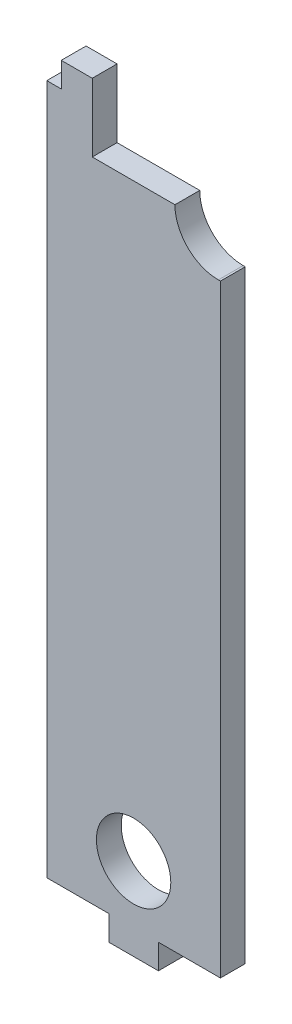
ISO-10303-21;
HEADER;
FILE_DESCRIPTION(('STEP AP214'),'2;1');
FILE_NAME('part.step','',(''),(''),'','','');
FILE_SCHEMA(('AUTOMOTIVE_DESIGN { 1 0 10303 214 1 1 1 1 }'));
ENDSEC;
DATA;
#1=APPLICATION_CONTEXT('core data for automotive mechanical design processes');
#2=APPLICATION_PROTOCOL_DEFINITION('international standard','automotive_design',2000,#1);
#3=PRODUCT_CONTEXT('',#1,'mechanical');
#4=PRODUCT('Part','Part','',(#3));
#5=PRODUCT_RELATED_PRODUCT_CATEGORY('part','',(#4));
#6=PRODUCT_DEFINITION_FORMATION('','',#4);
#7=PRODUCT_DEFINITION_CONTEXT('part definition',#1,'design');
#8=PRODUCT_DEFINITION('design','',#6,#7);
#9=PRODUCT_DEFINITION_SHAPE('','',#8);
#10=(LENGTH_UNIT() NAMED_UNIT(*) SI_UNIT(.MILLI.,.METRE.));
#11=(NAMED_UNIT(*) PLANE_ANGLE_UNIT() SI_UNIT($,.RADIAN.));
#12=(NAMED_UNIT(*) SI_UNIT($,.STERADIAN.) SOLID_ANGLE_UNIT());
#13=UNCERTAINTY_MEASURE_WITH_UNIT(LENGTH_MEASURE(1.E-05),#10,'distance_accuracy_value','');
#14=(GEOMETRIC_REPRESENTATION_CONTEXT(3) GLOBAL_UNCERTAINTY_ASSIGNED_CONTEXT((#13)) GLOBAL_UNIT_ASSIGNED_CONTEXT((#10,
#11,#12)) REPRESENTATION_CONTEXT('',''));
#15=CARTESIAN_POINT('',(0.,0.,0.));
#16=DIRECTION('',(0.,0.,1.));
#17=DIRECTION('',(1.,0.,0.));
#18=AXIS2_PLACEMENT_3D('',#15,#16,#17);
#19=CARTESIAN_POINT('',(20.5,73.,-6.));
#20=DIRECTION('',(0.,0.,1.));
#21=DIRECTION('',(1.,0.,0.));
#22=AXIS2_PLACEMENT_3D('',#19,#20,#21);
#23=CYLINDRICAL_SURFACE('',#22,10.5);
#24=CARTESIAN_POINT('',(20.5,73.,0.));
#25=DIRECTION('',(0.,0.,1.));
#26=DIRECTION('',(1.,0.,0.));
#27=AXIS2_PLACEMENT_3D('',#24,#25,#26);
#28=CIRCLE('',#27,10.5);
#29=CARTESIAN_POINT('',(10.,73.,0.));
#30=VERTEX_POINT('',#29);
#31=CARTESIAN_POINT('',(20.5,62.5,0.));
#32=VERTEX_POINT('',#31);
#33=EDGE_CURVE('E236',#30,#32,#28,.T.);
#34=ORIENTED_EDGE('',*,*,#33,.T.);
#35=DIRECTION('',(0.,0.,1.));
#36=VECTOR('',#35,1.);
#37=CARTESIAN_POINT('',(20.5,62.5,-6.));
#38=LINE('',#37,#36);
#39=CARTESIAN_POINT('',(20.5,62.5,-6.));
#40=VERTEX_POINT('',#39);
#41=EDGE_CURVE('E11',#40,#32,#38,.T.);
#42=ORIENTED_EDGE('',*,*,#41,.F.);
#43=CARTESIAN_POINT('',(20.5,73.,-6.));
#44=DIRECTION('',(0.,0.,1.));
#45=DIRECTION('',(1.,0.,0.));
#46=AXIS2_PLACEMENT_3D('',#43,#44,#45);
#47=CIRCLE('',#46,10.5);
#48=CARTESIAN_POINT('',(10.,73.,-6.));
#49=VERTEX_POINT('',#48);
#50=EDGE_CURVE('E195',#49,#40,#47,.T.);
#51=ORIENTED_EDGE('',*,*,#50,.F.);
#52=DIRECTION('',(0.,0.,1.));
#53=VECTOR('',#52,1.);
#54=CARTESIAN_POINT('',(10.,73.,-6.));
#55=LINE('',#54,#53);
#56=EDGE_CURVE('E44',#49,#30,#55,.T.);
#57=ORIENTED_EDGE('',*,*,#56,.T.);
#58=EDGE_LOOP('',(#34,#42,#51,#57));
#59=FACE_BOUND('',#58,.T.);
#60=ADVANCED_FACE('F41',(#59),#23,.F.);
#61=CARTESIAN_POINT('',(3.46944695195365E-12,62.5000000000011,-6.));
#62=DIRECTION('',(0.,-1.,0.));
#63=DIRECTION('',(1.,0.,0.));
#64=AXIS2_PLACEMENT_3D('',#61,#62,#63);
#65=PLANE('',#64);
#66=DIRECTION('',(1.,0.,0.));
#67=VECTOR('',#66,1.);
#68=CARTESIAN_POINT('',(3.46944695195365E-12,62.5000000000011,0.));
#69=LINE('',#68,#67);
#70=CARTESIAN_POINT('',(21.,62.5,0.));
#71=VERTEX_POINT('',#70);
#72=EDGE_CURVE('E110',#32,#71,#69,.T.);
#73=ORIENTED_EDGE('',*,*,#72,.T.);
#74=DIRECTION('',(0.,0.,1.));
#75=VECTOR('',#74,1.);
#76=CARTESIAN_POINT('',(21.,62.5,-6.));
#77=LINE('',#76,#75);
#78=CARTESIAN_POINT('',(21.,62.5,-6.));
#79=VERTEX_POINT('',#78);
#80=EDGE_CURVE('E50',#79,#71,#77,.T.);
#81=ORIENTED_EDGE('',*,*,#80,.F.);
#82=DIRECTION('',(1.,0.,0.));
#83=VECTOR('',#82,1.);
#84=CARTESIAN_POINT('',(3.46944695195365E-12,62.5000000000011,-6.));
#85=LINE('',#84,#83);
#86=EDGE_CURVE('E58',#40,#79,#85,.T.);
#87=ORIENTED_EDGE('',*,*,#86,.F.);
#88=ORIENTED_EDGE('',*,*,#41,.T.);
#89=EDGE_LOOP('',(#73,#81,#87,#88));
#90=FACE_BOUND('',#89,.T.);
#91=ADVANCED_FACE('F314',(#90),#65,.F.);
#92=CARTESIAN_POINT('',(21.,0.,-6.));
#93=DIRECTION('',(1.,0.,0.));
#94=DIRECTION('',(0.,1.,0.));
#95=AXIS2_PLACEMENT_3D('',#92,#93,#94);
#96=PLANE('',#95);
#97=DIRECTION('',(0.,1.,0.));
#98=VECTOR('',#97,1.);
#99=CARTESIAN_POINT('',(21.,0.,0.));
#100=LINE('',#99,#98);
#101=CARTESIAN_POINT('',(21.,-83.5,0.));
#102=VERTEX_POINT('',#101);
#103=EDGE_CURVE('E152',#102,#71,#100,.T.);
#104=ORIENTED_EDGE('',*,*,#103,.F.);
#105=DIRECTION('',(0.,0.,1.));
#106=VECTOR('',#105,1.);
#107=CARTESIAN_POINT('',(21.,-83.5,-6.));
#108=LINE('',#107,#106);
#109=CARTESIAN_POINT('',(21.,-83.5,-6.));
#110=VERTEX_POINT('',#109);
#111=EDGE_CURVE('E148',#110,#102,#108,.T.);
#112=ORIENTED_EDGE('',*,*,#111,.F.);
#113=DIRECTION('',(0.,1.,0.));
#114=VECTOR('',#113,1.);
#115=CARTESIAN_POINT('',(21.,0.,-6.));
#116=LINE('',#115,#114);
#117=EDGE_CURVE('E151',#110,#79,#116,.T.);
#118=ORIENTED_EDGE('',*,*,#117,.T.);
#119=ORIENTED_EDGE('',*,*,#80,.T.);
#120=EDGE_LOOP('',(#104,#112,#118,#119));
#121=FACE_BOUND('',#120,.T.);
#122=ADVANCED_FACE('F150',(#121),#96,.T.);
#123=CARTESIAN_POINT('',(0.,-83.5,-6.));
#124=DIRECTION('',(0.,-1.,0.));
#125=DIRECTION('',(0.,0.,-1.));
#126=AXIS2_PLACEMENT_3D('',#123,#124,#125);
#127=PLANE('',#126);
#128=DIRECTION('',(1.,0.,0.));
#129=VECTOR('',#128,1.);
#130=CARTESIAN_POINT('',(0.,-83.5,0.));
#131=LINE('',#130,#129);
#132=CARTESIAN_POINT('',(6.,-83.5,0.));
#133=VERTEX_POINT('',#132);
#134=EDGE_CURVE('E257',#133,#102,#131,.T.);
#135=ORIENTED_EDGE('',*,*,#134,.F.);
#136=DIRECTION('',(0.,0.,1.));
#137=VECTOR('',#136,1.);
#138=CARTESIAN_POINT('',(6.,-83.5,-6.));
#139=LINE('',#138,#137);
#140=CARTESIAN_POINT('',(6.,-83.5,-6.));
#141=VERTEX_POINT('',#140);
#142=EDGE_CURVE('E157',#141,#133,#139,.T.);
#143=ORIENTED_EDGE('',*,*,#142,.F.);
#144=DIRECTION('',(1.,0.,0.));
#145=VECTOR('',#144,1.);
#146=CARTESIAN_POINT('',(0.,-83.5,-6.));
#147=LINE('',#146,#145);
#148=EDGE_CURVE('E164',#141,#110,#147,.T.);
#149=ORIENTED_EDGE('',*,*,#148,.T.);
#150=ORIENTED_EDGE('',*,*,#111,.T.);
#151=EDGE_LOOP('',(#135,#143,#149,#150));
#152=FACE_BOUND('',#151,.T.);
#153=ADVANCED_FACE('F167',(#152),#127,.T.);
#154=CARTESIAN_POINT('',(5.99999999999996,0.,-6.));
#155=DIRECTION('',(1.,0.,0.));
#156=DIRECTION('',(0.,1.,0.));
#157=AXIS2_PLACEMENT_3D('',#154,#155,#156);
#158=PLANE('',#157);
#159=DIRECTION('',(0.,1.,0.));
#160=VECTOR('',#159,1.);
#161=CARTESIAN_POINT('',(5.99999999999996,0.,0.));
#162=LINE('',#161,#160);
#163=CARTESIAN_POINT('',(6.,-89.5,0.));
#164=VERTEX_POINT('',#163);
#165=EDGE_CURVE('E263',#164,#133,#162,.T.);
#166=ORIENTED_EDGE('',*,*,#165,.F.);
#167=DIRECTION('',(0.,0.,1.));
#168=VECTOR('',#167,1.);
#169=CARTESIAN_POINT('',(6.,-89.5,-6.));
#170=LINE('',#169,#168);
#171=CARTESIAN_POINT('',(6.,-89.5,-6.));
#172=VERTEX_POINT('',#171);
#173=EDGE_CURVE('E208',#172,#164,#170,.T.);
#174=ORIENTED_EDGE('',*,*,#173,.F.);
#175=DIRECTION('',(0.,1.,0.));
#176=VECTOR('',#175,1.);
#177=CARTESIAN_POINT('',(5.99999999999996,0.,-6.));
#178=LINE('',#177,#176);
#179=EDGE_CURVE('E168',#172,#141,#178,.T.);
#180=ORIENTED_EDGE('',*,*,#179,.T.);
#181=ORIENTED_EDGE('',*,*,#142,.T.);
#182=EDGE_LOOP('',(#166,#174,#180,#181));
#183=FACE_BOUND('',#182,.T.);
#184=ADVANCED_FACE('F270',(#183),#158,.T.);
#185=CARTESIAN_POINT('',(1.0350516739995E-13,-89.5,-6.));
#186=DIRECTION('',(0.,-1.,0.));
#187=DIRECTION('',(1.,0.,0.));
#188=AXIS2_PLACEMENT_3D('',#185,#186,#187);
#189=PLANE('',#188);
#190=DIRECTION('',(1.,0.,0.));
#191=VECTOR('',#190,1.);
#192=CARTESIAN_POINT('',(1.0350516739995E-13,-89.5,0.));
#193=LINE('',#192,#191);
#194=CARTESIAN_POINT('',(-6.,-89.5,0.));
#195=VERTEX_POINT('',#194);
#196=EDGE_CURVE('E260',#195,#164,#193,.T.);
#197=ORIENTED_EDGE('',*,*,#196,.F.);
#198=DIRECTION('',(0.,0.,1.));
#199=VECTOR('',#198,1.);
#200=CARTESIAN_POINT('',(-6.,-89.5,-6.));
#201=LINE('',#200,#199);
#202=CARTESIAN_POINT('',(-6.,-89.5,-6.));
#203=VERTEX_POINT('',#202);
#204=EDGE_CURVE('E210',#203,#195,#201,.T.);
#205=ORIENTED_EDGE('',*,*,#204,.F.);
#206=DIRECTION('',(1.,0.,0.));
#207=VECTOR('',#206,1.);
#208=CARTESIAN_POINT('',(1.0350516739995E-13,-89.5,-6.));
#209=LINE('',#208,#207);
#210=EDGE_CURVE('E171',#203,#172,#209,.T.);
#211=ORIENTED_EDGE('',*,*,#210,.T.);
#212=ORIENTED_EDGE('',*,*,#173,.T.);
#213=EDGE_LOOP('',(#197,#205,#211,#212));
#214=FACE_BOUND('',#213,.T.);
#215=ADVANCED_FACE('F275',(#214),#189,.T.);
#216=CARTESIAN_POINT('',(-5.99999999999999,0.,-6.));
#217=DIRECTION('',(-1.,0.,0.));
#218=DIRECTION('',(0.,-1.,0.));
#219=AXIS2_PLACEMENT_3D('',#216,#217,#218);
#220=PLANE('',#219);
#221=DIRECTION('',(0.,-1.,0.));
#222=VECTOR('',#221,1.);
#223=CARTESIAN_POINT('',(-5.99999999999999,0.,0.));
#224=LINE('',#223,#222);
#225=CARTESIAN_POINT('',(-6.,-83.5,0.));
#226=VERTEX_POINT('',#225);
#227=EDGE_CURVE('E256',#226,#195,#224,.T.);
#228=ORIENTED_EDGE('',*,*,#227,.F.);
#229=DIRECTION('',(0.,0.,1.));
#230=VECTOR('',#229,1.);
#231=CARTESIAN_POINT('',(-6.,-83.5,-6.));
#232=LINE('',#231,#230);
#233=CARTESIAN_POINT('',(-6.,-83.5,-6.));
#234=VERTEX_POINT('',#233);
#235=EDGE_CURVE('E212',#234,#226,#232,.T.);
#236=ORIENTED_EDGE('',*,*,#235,.F.);
#237=DIRECTION('',(0.,-1.,0.));
#238=VECTOR('',#237,1.);
#239=CARTESIAN_POINT('',(-5.99999999999999,0.,-6.));
#240=LINE('',#239,#238);
#241=EDGE_CURVE('E176',#234,#203,#240,.T.);
#242=ORIENTED_EDGE('',*,*,#241,.T.);
#243=ORIENTED_EDGE('',*,*,#204,.T.);
#244=EDGE_LOOP('',(#228,#236,#242,#243));
#245=FACE_BOUND('',#244,.T.);
#246=ADVANCED_FACE('F279',(#245),#220,.T.);
#247=CARTESIAN_POINT('',(-21.,-83.5,0.));
#248=VERTEX_POINT('',#247);
#249=EDGE_CURVE('E253',#248,#226,#131,.T.);
#250=ORIENTED_EDGE('',*,*,#249,.F.);
#251=DIRECTION('',(0.,0.,1.));
#252=VECTOR('',#251,1.);
#253=CARTESIAN_POINT('',(-21.,-83.5,-6.));
#254=LINE('',#253,#252);
#255=CARTESIAN_POINT('',(-21.,-83.5,-6.));
#256=VERTEX_POINT('',#255);
#257=EDGE_CURVE('E214',#256,#248,#254,.T.);
#258=ORIENTED_EDGE('',*,*,#257,.F.);
#259=EDGE_CURVE('E170',#256,#234,#147,.T.);
#260=ORIENTED_EDGE('',*,*,#259,.T.);
#261=ORIENTED_EDGE('',*,*,#235,.T.);
#262=EDGE_LOOP('',(#250,#258,#260,#261));
#263=FACE_BOUND('',#262,.T.);
#264=ADVANCED_FACE('F281',(#263),#127,.T.);
#265=CARTESIAN_POINT('',(-21.,0.,-6.));
#266=DIRECTION('',(1.,0.,0.));
#267=DIRECTION('',(0.,1.,0.));
#268=AXIS2_PLACEMENT_3D('',#265,#266,#267);
#269=PLANE('',#268);
#270=DIRECTION('',(0.,1.,0.));
#271=VECTOR('',#270,1.);
#272=CARTESIAN_POINT('',(-21.,0.,0.));
#273=LINE('',#272,#271);
#274=CARTESIAN_POINT('',(-21.,83.5,0.));
#275=VERTEX_POINT('',#274);
#276=EDGE_CURVE('E251',#248,#275,#273,.T.);
#277=ORIENTED_EDGE('',*,*,#276,.T.);
#278=DIRECTION('',(0.,0.,1.));
#279=VECTOR('',#278,1.);
#280=CARTESIAN_POINT('',(-21.,83.5,-6.));
#281=LINE('',#280,#279);
#282=CARTESIAN_POINT('',(-21.,83.5,-6.));
#283=VERTEX_POINT('',#282);
#284=EDGE_CURVE('E216',#283,#275,#281,.T.);
#285=ORIENTED_EDGE('',*,*,#284,.F.);
#286=DIRECTION('',(0.,1.,0.));
#287=VECTOR('',#286,1.);
#288=CARTESIAN_POINT('',(-21.,0.,-6.));
#289=LINE('',#288,#287);
#290=EDGE_CURVE('E177',#256,#283,#289,.T.);
#291=ORIENTED_EDGE('',*,*,#290,.F.);
#292=ORIENTED_EDGE('',*,*,#257,.T.);
#293=EDGE_LOOP('',(#277,#285,#291,#292));
#294=FACE_BOUND('',#293,.T.);
#295=ADVANCED_FACE('F286',(#294),#269,.F.);
#296=CARTESIAN_POINT('',(0.,83.5,-6.));
#297=DIRECTION('',(0.,-1.,0.));
#298=DIRECTION('',(0.,0.,-1.));
#299=AXIS2_PLACEMENT_3D('',#296,#297,#298);
#300=PLANE('',#299);
#301=DIRECTION('',(1.,0.,0.));
#302=VECTOR('',#301,1.);
#303=CARTESIAN_POINT('',(0.,83.5,0.));
#304=LINE('',#303,#302);
#305=CARTESIAN_POINT('',(-17.5,83.5,0.));
#306=VERTEX_POINT('',#305);
#307=EDGE_CURVE('E249',#275,#306,#304,.T.);
#308=ORIENTED_EDGE('',*,*,#307,.T.);
#309=DIRECTION('',(0.,0.,1.));
#310=VECTOR('',#309,1.);
#311=CARTESIAN_POINT('',(-17.5,83.5,-6.));
#312=LINE('',#311,#310);
#313=CARTESIAN_POINT('',(-17.5,83.5,-6.));
#314=VERTEX_POINT('',#313);
#315=EDGE_CURVE('E219',#314,#306,#312,.T.);
#316=ORIENTED_EDGE('',*,*,#315,.F.);
#317=DIRECTION('',(1.,0.,0.));
#318=VECTOR('',#317,1.);
#319=CARTESIAN_POINT('',(0.,83.5,-6.));
#320=LINE('',#319,#318);
#321=EDGE_CURVE('E181',#283,#314,#320,.T.);
#322=ORIENTED_EDGE('',*,*,#321,.F.);
#323=ORIENTED_EDGE('',*,*,#284,.T.);
#324=EDGE_LOOP('',(#308,#316,#322,#323));
#325=FACE_BOUND('',#324,.T.);
#326=ADVANCED_FACE('F289',(#325),#300,.F.);
#327=CARTESIAN_POINT('',(-17.5,0.,-6.));
#328=DIRECTION('',(1.,0.,0.));
#329=DIRECTION('',(0.,0.,-1.));
#330=AXIS2_PLACEMENT_3D('',#327,#328,#329);
#331=PLANE('',#330);
#332=DIRECTION('',(0.,1.,0.));
#333=VECTOR('',#332,1.);
#334=CARTESIAN_POINT('',(-17.5,0.,0.));
#335=LINE('',#334,#333);
#336=CARTESIAN_POINT('',(-17.5,89.5,0.));
#337=VERTEX_POINT('',#336);
#338=EDGE_CURVE('E247',#306,#337,#335,.T.);
#339=ORIENTED_EDGE('',*,*,#338,.T.);
#340=DIRECTION('',(0.,0.,1.));
#341=VECTOR('',#340,1.);
#342=CARTESIAN_POINT('',(-17.5,89.5,-6.));
#343=LINE('',#342,#341);
#344=CARTESIAN_POINT('',(-17.5,89.5,-6.));
#345=VERTEX_POINT('',#344);
#346=EDGE_CURVE('E222',#345,#337,#343,.T.);
#347=ORIENTED_EDGE('',*,*,#346,.F.);
#348=DIRECTION('',(0.,1.,0.));
#349=VECTOR('',#348,1.);
#350=CARTESIAN_POINT('',(-17.5,0.,-6.));
#351=LINE('',#350,#349);
#352=EDGE_CURVE('E184',#314,#345,#351,.T.);
#353=ORIENTED_EDGE('',*,*,#352,.F.);
#354=ORIENTED_EDGE('',*,*,#315,.T.);
#355=EDGE_LOOP('',(#339,#347,#353,#354));
#356=FACE_BOUND('',#355,.T.);
#357=ADVANCED_FACE('F297',(#356),#331,.F.);
#358=CARTESIAN_POINT('',(0.,89.5,-6.));
#359=DIRECTION('',(0.,-1.,0.));
#360=DIRECTION('',(0.,0.,-1.));
#361=AXIS2_PLACEMENT_3D('',#358,#359,#360);
#362=PLANE('',#361);
#363=DIRECTION('',(1.,0.,0.));
#364=VECTOR('',#363,1.);
#365=CARTESIAN_POINT('',(0.,89.5,0.));
#366=LINE('',#365,#364);
#367=CARTESIAN_POINT('',(-10.,89.5,0.));
#368=VERTEX_POINT('',#367);
#369=EDGE_CURVE('E244',#337,#368,#366,.T.);
#370=ORIENTED_EDGE('',*,*,#369,.T.);
#371=DIRECTION('',(0.,0.,1.));
#372=VECTOR('',#371,1.);
#373=CARTESIAN_POINT('',(-10.,89.5,-6.));
#374=LINE('',#373,#372);
#375=CARTESIAN_POINT('',(-10.,89.5,-6.));
#376=VERTEX_POINT('',#375);
#377=EDGE_CURVE('E225',#376,#368,#374,.T.);
#378=ORIENTED_EDGE('',*,*,#377,.F.);
#379=DIRECTION('',(1.,0.,0.));
#380=VECTOR('',#379,1.);
#381=CARTESIAN_POINT('',(0.,89.5,-6.));
#382=LINE('',#381,#380);
#383=EDGE_CURVE('E188',#345,#376,#382,.T.);
#384=ORIENTED_EDGE('',*,*,#383,.F.);
#385=ORIENTED_EDGE('',*,*,#346,.T.);
#386=EDGE_LOOP('',(#370,#378,#384,#385));
#387=FACE_BOUND('',#386,.T.);
#388=ADVANCED_FACE('F300',(#387),#362,.F.);
#389=CARTESIAN_POINT('',(-10.,0.,-6.));
#390=DIRECTION('',(1.,0.,0.));
#391=DIRECTION('',(0.,0.,-1.));
#392=AXIS2_PLACEMENT_3D('',#389,#390,#391);
#393=PLANE('',#392);
#394=DIRECTION('',(0.,1.,0.));
#395=VECTOR('',#394,1.);
#396=CARTESIAN_POINT('',(-10.,0.,0.));
#397=LINE('',#396,#395);
#398=CARTESIAN_POINT('',(-10.,73.,0.));
#399=VERTEX_POINT('',#398);
#400=EDGE_CURVE('E241',#399,#368,#397,.T.);
#401=ORIENTED_EDGE('',*,*,#400,.F.);
#402=DIRECTION('',(0.,0.,1.));
#403=VECTOR('',#402,1.);
#404=CARTESIAN_POINT('',(-10.,73.,-6.));
#405=LINE('',#404,#403);
#406=CARTESIAN_POINT('',(-10.,73.,-6.));
#407=VERTEX_POINT('',#406);
#408=EDGE_CURVE('E226',#407,#399,#405,.T.);
#409=ORIENTED_EDGE('',*,*,#408,.F.);
#410=DIRECTION('',(0.,1.,0.));
#411=VECTOR('',#410,1.);
#412=CARTESIAN_POINT('',(-10.,0.,-6.));
#413=LINE('',#412,#411);
#414=EDGE_CURVE('E190',#407,#376,#413,.T.);
#415=ORIENTED_EDGE('',*,*,#414,.T.);
#416=ORIENTED_EDGE('',*,*,#377,.T.);
#417=EDGE_LOOP('',(#401,#409,#415,#416));
#418=FACE_BOUND('',#417,.T.);
#419=ADVANCED_FACE('F302',(#418),#393,.T.);
#420=CARTESIAN_POINT('',(0.,73.,-6.));
#421=DIRECTION('',(0.,1.,0.));
#422=DIRECTION('',(0.,0.,1.));
#423=AXIS2_PLACEMENT_3D('',#420,#421,#422);
#424=PLANE('',#423);
#425=DIRECTION('',(-1.,0.,0.));
#426=VECTOR('',#425,1.);
#427=CARTESIAN_POINT('',(0.,73.,0.));
#428=LINE('',#427,#426);
#429=EDGE_CURVE('E238',#30,#399,#428,.T.);
#430=ORIENTED_EDGE('',*,*,#429,.F.);
#431=ORIENTED_EDGE('',*,*,#56,.F.);
#432=DIRECTION('',(-1.,0.,0.));
#433=VECTOR('',#432,1.);
#434=CARTESIAN_POINT('',(0.,73.,-6.));
#435=LINE('',#434,#433);
#436=EDGE_CURVE('E193',#49,#407,#435,.T.);
#437=ORIENTED_EDGE('',*,*,#436,.T.);
#438=ORIENTED_EDGE('',*,*,#408,.T.);
#439=EDGE_LOOP('',(#430,#431,#437,#438));
#440=FACE_BOUND('',#439,.T.);
#441=ADVANCED_FACE('F303',(#440),#424,.T.);
#442=CARTESIAN_POINT('',(0.,-69.5,-6.));
#443=DIRECTION('',(0.,0.,1.));
#444=DIRECTION('',(1.,0.,0.));
#445=AXIS2_PLACEMENT_3D('',#442,#443,#444);
#446=CYLINDRICAL_SURFACE('',#445,9.);
#447=CARTESIAN_POINT('',(0.,-69.5,-6.));
#448=DIRECTION('',(0.,0.,1.));
#449=DIRECTION('',(1.,0.,0.));
#450=AXIS2_PLACEMENT_3D('',#447,#448,#449);
#451=CIRCLE('',#450,9.);
#452=CARTESIAN_POINT('',(9.,-69.5,-6.));
#453=VERTEX_POINT('',#452);
#454=EDGE_CURVE('E228',#453,#453,#451,.T.);
#455=ORIENTED_EDGE('',*,*,#454,.F.);
#456=EDGE_LOOP('',(#455));
#457=FACE_BOUND('',#456,.T.);
#458=CARTESIAN_POINT('',(0.,-69.5,0.));
#459=DIRECTION('',(0.,0.,1.));
#460=DIRECTION('',(1.,0.,0.));
#461=AXIS2_PLACEMENT_3D('',#458,#459,#460);
#462=CIRCLE('',#461,9.);
#463=CARTESIAN_POINT('',(9.,-69.5,0.));
#464=VERTEX_POINT('',#463);
#465=EDGE_CURVE('E196',#464,#464,#462,.T.);
#466=ORIENTED_EDGE('',*,*,#465,.T.);
#467=EDGE_LOOP('',(#466));
#468=FACE_BOUND('',#467,.T.);
#469=ADVANCED_FACE('F305',(#457,#468),#446,.F.);
#470=CARTESIAN_POINT('',(0.,0.,-6.));
#471=DIRECTION('',(0.,0.,1.));
#472=DIRECTION('',(1.,0.,0.));
#473=AXIS2_PLACEMENT_3D('',#470,#471,#472);
#474=PLANE('',#473);
#475=ORIENTED_EDGE('',*,*,#50,.T.);
#476=ORIENTED_EDGE('',*,*,#86,.T.);
#477=ORIENTED_EDGE('',*,*,#117,.F.);
#478=ORIENTED_EDGE('',*,*,#148,.F.);
#479=ORIENTED_EDGE('',*,*,#179,.F.);
#480=ORIENTED_EDGE('',*,*,#210,.F.);
#481=ORIENTED_EDGE('',*,*,#241,.F.);
#482=ORIENTED_EDGE('',*,*,#259,.F.);
#483=ORIENTED_EDGE('',*,*,#290,.T.);
#484=ORIENTED_EDGE('',*,*,#321,.T.);
#485=ORIENTED_EDGE('',*,*,#352,.T.);
#486=ORIENTED_EDGE('',*,*,#383,.T.);
#487=ORIENTED_EDGE('',*,*,#414,.F.);
#488=ORIENTED_EDGE('',*,*,#436,.F.);
#489=EDGE_LOOP('',(#475,#476,#477,#478,#479,#480,#481,#482,#483,#484,#485,#486,#487,#488));
#490=FACE_BOUND('',#489,.T.);
#491=ORIENTED_EDGE('',*,*,#454,.T.);
#492=EDGE_LOOP('',(#491));
#493=FACE_BOUND('',#492,.T.);
#494=ADVANCED_FACE('F161',(#490,#493),#474,.F.);
#495=CARTESIAN_POINT('',(0.,0.,0.));
#496=DIRECTION('',(0.,0.,1.));
#497=DIRECTION('',(1.,0.,0.));
#498=AXIS2_PLACEMENT_3D('',#495,#496,#497);
#499=PLANE('',#498);
#500=ORIENTED_EDGE('',*,*,#33,.F.);
#501=ORIENTED_EDGE('',*,*,#429,.T.);
#502=ORIENTED_EDGE('',*,*,#400,.T.);
#503=ORIENTED_EDGE('',*,*,#369,.F.);
#504=ORIENTED_EDGE('',*,*,#338,.F.);
#505=ORIENTED_EDGE('',*,*,#307,.F.);
#506=ORIENTED_EDGE('',*,*,#276,.F.);
#507=ORIENTED_EDGE('',*,*,#249,.T.);
#508=ORIENTED_EDGE('',*,*,#227,.T.);
#509=ORIENTED_EDGE('',*,*,#196,.T.);
#510=ORIENTED_EDGE('',*,*,#165,.T.);
#511=ORIENTED_EDGE('',*,*,#134,.T.);
#512=ORIENTED_EDGE('',*,*,#103,.T.);
#513=ORIENTED_EDGE('',*,*,#72,.F.);
#514=EDGE_LOOP('',(#500,#501,#502,#503,#504,#505,#506,#507,#508,#509,#510,#511,#512,#513));
#515=FACE_BOUND('',#514,.T.);
#516=ORIENTED_EDGE('',*,*,#465,.F.);
#517=EDGE_LOOP('',(#516));
#518=FACE_BOUND('',#517,.T.);
#519=ADVANCED_FACE('F265',(#515,#518),#499,.T.);
#520=CLOSED_SHELL('',(#60,#91,#122,#153,#184,#215,#246,#264,#295,#326,#357,#388,#419,#441,#469,
#494,#519));
#521=MANIFOLD_SOLID_BREP('B2',#520);
#522=ADVANCED_BREP_SHAPE_REPRESENTATION('',(#18,#521),#14);
#523=SHAPE_DEFINITION_REPRESENTATION(#9,#522);
ENDSEC;
END-ISO-10303-21;
